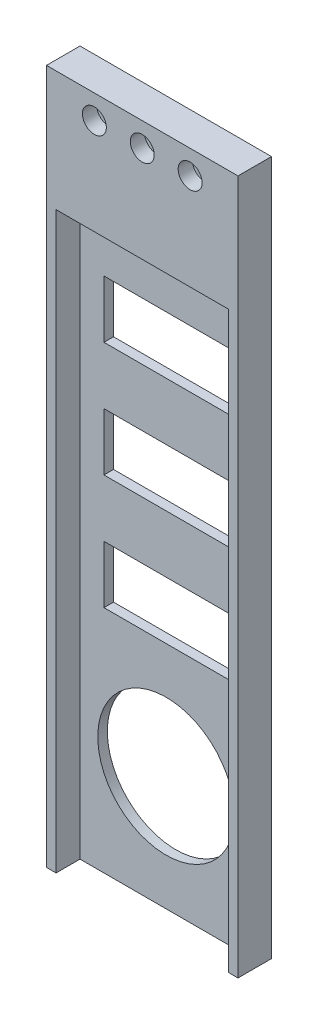
ISO-10303-21;
HEADER;
FILE_DESCRIPTION(('STEP AP214'),'2;1');
FILE_NAME('part.step','',(''),(''),'','','');
FILE_SCHEMA(('AUTOMOTIVE_DESIGN { 1 0 10303 214 1 1 1 1 }'));
ENDSEC;
DATA;
#1=APPLICATION_CONTEXT('core data for automotive mechanical design processes');
#2=APPLICATION_PROTOCOL_DEFINITION('international standard','automotive_design',2000,#1);
#3=PRODUCT_CONTEXT('',#1,'mechanical');
#4=PRODUCT('Part','Part','',(#3));
#5=PRODUCT_RELATED_PRODUCT_CATEGORY('part','',(#4));
#6=PRODUCT_DEFINITION_FORMATION('','',#4);
#7=PRODUCT_DEFINITION_CONTEXT('part definition',#1,'design');
#8=PRODUCT_DEFINITION('design','',#6,#7);
#9=PRODUCT_DEFINITION_SHAPE('','',#8);
#10=(LENGTH_UNIT() NAMED_UNIT(*) SI_UNIT(.MILLI.,.METRE.));
#11=(NAMED_UNIT(*) PLANE_ANGLE_UNIT() SI_UNIT($,.RADIAN.));
#12=(NAMED_UNIT(*) SI_UNIT($,.STERADIAN.) SOLID_ANGLE_UNIT());
#13=UNCERTAINTY_MEASURE_WITH_UNIT(LENGTH_MEASURE(1.E-05),#10,'distance_accuracy_value','');
#14=(GEOMETRIC_REPRESENTATION_CONTEXT(3) GLOBAL_UNCERTAINTY_ASSIGNED_CONTEXT((#13)) GLOBAL_UNIT_ASSIGNED_CONTEXT((#10,
#11,#12)) REPRESENTATION_CONTEXT('',''));
#15=CARTESIAN_POINT('',(0.,0.,0.));
#16=DIRECTION('',(0.,0.,1.));
#17=DIRECTION('',(1.,0.,0.));
#18=AXIS2_PLACEMENT_3D('',#15,#16,#17);
#19=CARTESIAN_POINT('',(20.,140.1,0.));
#20=DIRECTION('',(0.,0.,1.));
#21=DIRECTION('',(1.,0.,0.));
#22=AXIS2_PLACEMENT_3D('',#19,#20,#21);
#23=CYLINDRICAL_SURFACE('',#22,1.25);
#24=CARTESIAN_POINT('',(20.,140.1,0.));
#25=DIRECTION('',(0.,0.,1.));
#26=DIRECTION('',(1.,0.,0.));
#27=AXIS2_PLACEMENT_3D('',#24,#25,#26);
#28=CIRCLE('',#27,1.25);
#29=CARTESIAN_POINT('',(21.25,140.1,0.));
#30=VERTEX_POINT('',#29);
#31=EDGE_CURVE('E296',#30,#30,#28,.T.);
#32=ORIENTED_EDGE('',*,*,#31,.F.);
#33=EDGE_LOOP('',(#32));
#34=FACE_BOUND('',#33,.T.);
#35=CARTESIAN_POINT('',(20.,140.1,4.));
#36=DIRECTION('',(0.,0.,1.));
#37=DIRECTION('',(1.,0.,0.));
#38=AXIS2_PLACEMENT_3D('',#35,#36,#37);
#39=CIRCLE('',#38,1.25);
#40=CARTESIAN_POINT('',(21.25,140.1,4.));
#41=VERTEX_POINT('',#40);
#42=EDGE_CURVE('E38',#41,#41,#39,.F.);
#43=ORIENTED_EDGE('',*,*,#42,.F.);
#44=EDGE_LOOP('',(#43));
#45=FACE_BOUND('',#44,.T.);
#46=ADVANCED_FACE('F34',(#34,#45),#23,.F.);
#47=CARTESIAN_POINT('',(10.,140.1,0.));
#48=DIRECTION('',(0.,0.,1.));
#49=DIRECTION('',(1.,0.,0.));
#50=AXIS2_PLACEMENT_3D('',#47,#48,#49);
#51=CYLINDRICAL_SURFACE('',#50,1.25);
#52=CARTESIAN_POINT('',(10.,140.1,0.));
#53=DIRECTION('',(0.,0.,1.));
#54=DIRECTION('',(1.,0.,0.));
#55=AXIS2_PLACEMENT_3D('',#52,#53,#54);
#56=CIRCLE('',#55,1.25);
#57=CARTESIAN_POINT('',(11.25,140.1,0.));
#58=VERTEX_POINT('',#57);
#59=EDGE_CURVE('E293',#58,#58,#56,.T.);
#60=ORIENTED_EDGE('',*,*,#59,.F.);
#61=EDGE_LOOP('',(#60));
#62=FACE_BOUND('',#61,.T.);
#63=CARTESIAN_POINT('',(10.,140.1,4.));
#64=DIRECTION('',(0.,0.,1.));
#65=DIRECTION('',(1.,0.,0.));
#66=AXIS2_PLACEMENT_3D('',#63,#64,#65);
#67=CIRCLE('',#66,1.25);
#68=CARTESIAN_POINT('',(11.25,140.1,4.));
#69=VERTEX_POINT('',#68);
#70=EDGE_CURVE('E369',#69,#69,#67,.F.);
#71=ORIENTED_EDGE('',*,*,#70,.F.);
#72=EDGE_LOOP('',(#71));
#73=FACE_BOUND('',#72,.T.);
#74=ADVANCED_FACE('F379',(#62,#73),#51,.F.);
#75=CARTESIAN_POINT('',(30.,140.1,0.));
#76=DIRECTION('',(0.,0.,1.));
#77=DIRECTION('',(1.,0.,0.));
#78=AXIS2_PLACEMENT_3D('',#75,#76,#77);
#79=CYLINDRICAL_SURFACE('',#78,1.25);
#80=CARTESIAN_POINT('',(30.,140.1,0.));
#81=DIRECTION('',(0.,0.,1.));
#82=DIRECTION('',(1.,0.,0.));
#83=AXIS2_PLACEMENT_3D('',#80,#81,#82);
#84=CIRCLE('',#83,1.25);
#85=CARTESIAN_POINT('',(31.25,140.1,0.));
#86=VERTEX_POINT('',#85);
#87=EDGE_CURVE('E297',#86,#86,#84,.T.);
#88=ORIENTED_EDGE('',*,*,#87,.F.);
#89=EDGE_LOOP('',(#88));
#90=FACE_BOUND('',#89,.T.);
#91=CARTESIAN_POINT('',(30.,140.1,4.));
#92=DIRECTION('',(0.,0.,1.));
#93=DIRECTION('',(1.,0.,0.));
#94=AXIS2_PLACEMENT_3D('',#91,#92,#93);
#95=CIRCLE('',#94,1.25);
#96=CARTESIAN_POINT('',(31.25,140.1,4.));
#97=VERTEX_POINT('',#96);
#98=EDGE_CURVE('E278',#97,#97,#95,.F.);
#99=ORIENTED_EDGE('',*,*,#98,.F.);
#100=EDGE_LOOP('',(#99));
#101=FACE_BOUND('',#100,.T.);
#102=ADVANCED_FACE('F385',(#90,#101),#79,.F.);
#103=CARTESIAN_POINT('',(0.,0.,2.));
#104=DIRECTION('',(0.,0.,-1.));
#105=DIRECTION('',(-1.,0.,0.));
#106=AXIS2_PLACEMENT_3D('',#103,#104,#105);
#107=PLANE('',#106);
#108=DIRECTION('',(1.,0.,0.));
#109=VECTOR('',#108,1.);
#110=CARTESIAN_POINT('',(7.,96.,2.));
#111=LINE('',#110,#109);
#112=CARTESIAN_POINT('',(7.,96.,2.));
#113=VERTEX_POINT('',#112);
#114=CARTESIAN_POINT('',(33.,96.,2.));
#115=VERTEX_POINT('',#114);
#116=EDGE_CURVE('E203',#113,#115,#111,.T.);
#117=ORIENTED_EDGE('',*,*,#116,.F.);
#118=DIRECTION('',(0.,-1.,0.));
#119=VECTOR('',#118,1.);
#120=CARTESIAN_POINT('',(7.,108.,2.));
#121=LINE('',#120,#119);
#122=CARTESIAN_POINT('',(7.,108.,2.));
#123=VERTEX_POINT('',#122);
#124=EDGE_CURVE('E51',#123,#113,#121,.T.);
#125=ORIENTED_EDGE('',*,*,#124,.F.);
#126=DIRECTION('',(-1.,0.,0.));
#127=VECTOR('',#126,1.);
#128=CARTESIAN_POINT('',(7.,108.,2.));
#129=LINE('',#128,#127);
#130=CARTESIAN_POINT('',(33.,108.,2.));
#131=VERTEX_POINT('',#130);
#132=EDGE_CURVE('E194',#131,#123,#129,.T.);
#133=ORIENTED_EDGE('',*,*,#132,.F.);
#134=DIRECTION('',(0.,1.,0.));
#135=VECTOR('',#134,1.);
#136=CARTESIAN_POINT('',(33.,108.,2.));
#137=LINE('',#136,#135);
#138=EDGE_CURVE('E197',#115,#131,#137,.T.);
#139=ORIENTED_EDGE('',*,*,#138,.F.);
#140=EDGE_LOOP('',(#117,#125,#133,#139));
#141=FACE_BOUND('',#140,.T.);
#142=DIRECTION('',(1.,0.,0.));
#143=VECTOR('',#142,1.);
#144=CARTESIAN_POINT('',(6.99999999999999,72.,2.));
#145=LINE('',#144,#143);
#146=CARTESIAN_POINT('',(6.99999999999999,72.,2.));
#147=VERTEX_POINT('',#146);
#148=CARTESIAN_POINT('',(33.,72.,2.));
#149=VERTEX_POINT('',#148);
#150=EDGE_CURVE('E229',#147,#149,#145,.T.);
#151=ORIENTED_EDGE('',*,*,#150,.F.);
#152=DIRECTION('',(0.,-1.,0.));
#153=VECTOR('',#152,1.);
#154=CARTESIAN_POINT('',(6.99999999999999,84.,2.));
#155=LINE('',#154,#153);
#156=CARTESIAN_POINT('',(6.99999999999999,84.,2.));
#157=VERTEX_POINT('',#156);
#158=EDGE_CURVE('E59',#157,#147,#155,.T.);
#159=ORIENTED_EDGE('',*,*,#158,.F.);
#160=DIRECTION('',(-1.,0.,0.));
#161=VECTOR('',#160,1.);
#162=CARTESIAN_POINT('',(6.99999999999999,84.,2.));
#163=LINE('',#162,#161);
#164=CARTESIAN_POINT('',(33.,84.,2.));
#165=VERTEX_POINT('',#164);
#166=EDGE_CURVE('E218',#165,#157,#163,.T.);
#167=ORIENTED_EDGE('',*,*,#166,.F.);
#168=DIRECTION('',(0.,1.,0.));
#169=VECTOR('',#168,1.);
#170=CARTESIAN_POINT('',(33.,84.,2.));
#171=LINE('',#170,#169);
#172=EDGE_CURVE('E233',#149,#165,#171,.T.);
#173=ORIENTED_EDGE('',*,*,#172,.F.);
#174=EDGE_LOOP('',(#151,#159,#167,#173));
#175=FACE_BOUND('',#174,.T.);
#176=DIRECTION('',(1.,0.,0.));
#177=VECTOR('',#176,1.);
#178=CARTESIAN_POINT('',(6.99999999999999,48.,2.));
#179=LINE('',#178,#177);
#180=CARTESIAN_POINT('',(6.99999999999999,48.,2.));
#181=VERTEX_POINT('',#180);
#182=CARTESIAN_POINT('',(33.,48.,2.));
#183=VERTEX_POINT('',#182);
#184=EDGE_CURVE('E260',#181,#183,#179,.T.);
#185=ORIENTED_EDGE('',*,*,#184,.F.);
#186=DIRECTION('',(0.,-1.,0.));
#187=VECTOR('',#186,1.);
#188=CARTESIAN_POINT('',(6.99999999999999,48.,2.));
#189=LINE('',#188,#187);
#190=CARTESIAN_POINT('',(6.99999999999999,60.,2.));
#191=VERTEX_POINT('',#190);
#192=EDGE_CURVE('E258',#191,#181,#189,.T.);
#193=ORIENTED_EDGE('',*,*,#192,.F.);
#194=DIRECTION('',(-1.,0.,0.));
#195=VECTOR('',#194,1.);
#196=CARTESIAN_POINT('',(6.99999999999999,60.,2.));
#197=LINE('',#196,#195);
#198=CARTESIAN_POINT('',(33.,60.,2.));
#199=VERTEX_POINT('',#198);
#200=EDGE_CURVE('E248',#199,#191,#197,.T.);
#201=ORIENTED_EDGE('',*,*,#200,.F.);
#202=DIRECTION('',(0.,1.,0.));
#203=VECTOR('',#202,1.);
#204=CARTESIAN_POINT('',(33.,48.,2.));
#205=LINE('',#204,#203);
#206=EDGE_CURVE('E263',#183,#199,#205,.T.);
#207=ORIENTED_EDGE('',*,*,#206,.F.);
#208=EDGE_LOOP('',(#185,#193,#201,#207));
#209=FACE_BOUND('',#208,.T.);
#210=CARTESIAN_POINT('',(20.,24.,2.));
#211=DIRECTION('',(0.,0.,1.));
#212=DIRECTION('',(1.,0.,0.));
#213=AXIS2_PLACEMENT_3D('',#210,#211,#212);
#214=CIRCLE('',#213,14.29);
#215=CARTESIAN_POINT('',(34.29,24.,2.));
#216=VERTEX_POINT('',#215);
#217=EDGE_CURVE('E343',#216,#216,#214,.T.);
#218=ORIENTED_EDGE('',*,*,#217,.F.);
#219=EDGE_LOOP('',(#218));
#220=FACE_BOUND('',#219,.T.);
#221=DIRECTION('',(0.,-1.,0.));
#222=VECTOR('',#221,1.);
#223=CARTESIAN_POINT('',(38.,0.,2.));
#224=LINE('',#223,#222);
#225=CARTESIAN_POINT('',(38.,120.,2.));
#226=VERTEX_POINT('',#225);
#227=CARTESIAN_POINT('',(38.,0.,2.));
#228=VERTEX_POINT('',#227);
#229=EDGE_CURVE('E307',#226,#228,#224,.T.);
#230=ORIENTED_EDGE('',*,*,#229,.F.);
#231=DIRECTION('',(1.,0.,0.));
#232=VECTOR('',#231,1.);
#233=CARTESIAN_POINT('',(38.,120.,2.));
#234=LINE('',#233,#232);
#235=CARTESIAN_POINT('',(1.99999999999999,120.,2.));
#236=VERTEX_POINT('',#235);
#237=EDGE_CURVE('E327',#236,#226,#234,.T.);
#238=ORIENTED_EDGE('',*,*,#237,.F.);
#239=DIRECTION('',(0.,1.,0.));
#240=VECTOR('',#239,1.);
#241=CARTESIAN_POINT('',(1.99999999999999,120.,2.));
#242=LINE('',#241,#240);
#243=CARTESIAN_POINT('',(1.99999999999999,0.,2.));
#244=VERTEX_POINT('',#243);
#245=EDGE_CURVE('E302',#244,#236,#242,.T.);
#246=ORIENTED_EDGE('',*,*,#245,.F.);
#247=DIRECTION('',(1.,0.,0.));
#248=VECTOR('',#247,1.);
#249=CARTESIAN_POINT('',(0.,0.,2.));
#250=LINE('',#249,#248);
#251=EDGE_CURVE('E350',#244,#228,#250,.T.);
#252=ORIENTED_EDGE('',*,*,#251,.T.);
#253=EDGE_LOOP('',(#230,#238,#246,#252));
#254=FACE_BOUND('',#253,.T.);
#255=ADVANCED_FACE('F412',(#141,#175,#209,#220,#254),#107,.F.);
#256=CARTESIAN_POINT('',(0.,0.,2.));
#257=DIRECTION('',(1.,0.,0.));
#258=DIRECTION('',(0.,0.,-1.));
#259=AXIS2_PLACEMENT_3D('',#256,#257,#258);
#260=PLANE('',#259);
#261=DIRECTION('',(0.,-1.,0.));
#262=VECTOR('',#261,1.);
#263=CARTESIAN_POINT('',(0.,0.,0.));
#264=LINE('',#263,#262);
#265=CARTESIAN_POINT('',(0.,145.1,0.));
#266=VERTEX_POINT('',#265);
#267=CARTESIAN_POINT('',(0.,0.,0.));
#268=VERTEX_POINT('',#267);
#269=EDGE_CURVE('E347',#266,#268,#264,.T.);
#270=ORIENTED_EDGE('',*,*,#269,.T.);
#271=DIRECTION('',(0.,0.,-1.));
#272=VECTOR('',#271,1.);
#273=CARTESIAN_POINT('',(0.,0.,2.));
#274=LINE('',#273,#272);
#275=CARTESIAN_POINT('',(0.,0.,7.));
#276=VERTEX_POINT('',#275);
#277=EDGE_CURVE('E11',#276,#268,#274,.T.);
#278=ORIENTED_EDGE('',*,*,#277,.F.);
#279=DIRECTION('',(0.,-1.,0.));
#280=VECTOR('',#279,1.);
#281=CARTESIAN_POINT('',(0.,0.,7.));
#282=LINE('',#281,#280);
#283=CARTESIAN_POINT('',(0.,145.1,7.));
#284=VERTEX_POINT('',#283);
#285=EDGE_CURVE('E303',#284,#276,#282,.T.);
#286=ORIENTED_EDGE('',*,*,#285,.F.);
#287=DIRECTION('',(0.,0.,-1.));
#288=VECTOR('',#287,1.);
#289=CARTESIAN_POINT('',(0.,145.1,2.));
#290=LINE('',#289,#288);
#291=EDGE_CURVE('E352',#284,#266,#290,.T.);
#292=ORIENTED_EDGE('',*,*,#291,.T.);
#293=EDGE_LOOP('',(#270,#278,#286,#292));
#294=FACE_BOUND('',#293,.T.);
#295=ADVANCED_FACE('F36',(#294),#260,.F.);
#296=CARTESIAN_POINT('',(0.,0.,2.));
#297=DIRECTION('',(0.,1.,0.));
#298=DIRECTION('',(0.,0.,1.));
#299=AXIS2_PLACEMENT_3D('',#296,#297,#298);
#300=PLANE('',#299);
#301=DIRECTION('',(1.,0.,0.));
#302=VECTOR('',#301,1.);
#303=CARTESIAN_POINT('',(0.,0.,0.));
#304=LINE('',#303,#302);
#305=CARTESIAN_POINT('',(40.,0.,0.));
#306=VERTEX_POINT('',#305);
#307=EDGE_CURVE('E356',#268,#306,#304,.T.);
#308=ORIENTED_EDGE('',*,*,#307,.T.);
#309=DIRECTION('',(0.,0.,-1.));
#310=VECTOR('',#309,1.);
#311=CARTESIAN_POINT('',(40.,0.,2.));
#312=LINE('',#311,#310);
#313=CARTESIAN_POINT('',(40.,0.,7.));
#314=VERTEX_POINT('',#313);
#315=EDGE_CURVE('E43',#314,#306,#312,.T.);
#316=ORIENTED_EDGE('',*,*,#315,.F.);
#317=DIRECTION('',(1.,0.,0.));
#318=VECTOR('',#317,1.);
#319=CARTESIAN_POINT('',(40.,0.,7.));
#320=LINE('',#319,#318);
#321=CARTESIAN_POINT('',(38.,0.,7.));
#322=VERTEX_POINT('',#321);
#323=EDGE_CURVE('E315',#322,#314,#320,.T.);
#324=ORIENTED_EDGE('',*,*,#323,.F.);
#325=DIRECTION('',(0.,0.,-1.));
#326=VECTOR('',#325,1.);
#327=CARTESIAN_POINT('',(38.,0.,7.));
#328=LINE('',#327,#326);
#329=EDGE_CURVE('E324',#322,#228,#328,.T.);
#330=ORIENTED_EDGE('',*,*,#329,.T.);
#331=ORIENTED_EDGE('',*,*,#251,.F.);
#332=DIRECTION('',(0.,0.,-1.));
#333=VECTOR('',#332,1.);
#334=CARTESIAN_POINT('',(2.,0.,7.));
#335=LINE('',#334,#333);
#336=CARTESIAN_POINT('',(2.,0.,7.));
#337=VERTEX_POINT('',#336);
#338=EDGE_CURVE('E340',#337,#244,#335,.T.);
#339=ORIENTED_EDGE('',*,*,#338,.F.);
#340=DIRECTION('',(1.,0.,0.));
#341=VECTOR('',#340,1.);
#342=CARTESIAN_POINT('',(2.,0.,7.));
#343=LINE('',#342,#341);
#344=EDGE_CURVE('E306',#276,#337,#343,.T.);
#345=ORIENTED_EDGE('',*,*,#344,.F.);
#346=ORIENTED_EDGE('',*,*,#277,.T.);
#347=EDGE_LOOP('',(#308,#316,#324,#330,#331,#339,#345,#346));
#348=FACE_BOUND('',#347,.T.);
#349=ADVANCED_FACE('F424',(#348),#300,.F.);
#350=CARTESIAN_POINT('',(40.,0.,2.));
#351=DIRECTION('',(-1.,0.,0.));
#352=DIRECTION('',(0.,0.,1.));
#353=AXIS2_PLACEMENT_3D('',#350,#351,#352);
#354=PLANE('',#353);
#355=DIRECTION('',(0.,1.,0.));
#356=VECTOR('',#355,1.);
#357=CARTESIAN_POINT('',(40.,0.,0.));
#358=LINE('',#357,#356);
#359=CARTESIAN_POINT('',(40.,145.1,0.));
#360=VERTEX_POINT('',#359);
#361=EDGE_CURVE('E358',#306,#360,#358,.T.);
#362=ORIENTED_EDGE('',*,*,#361,.T.);
#363=DIRECTION('',(0.,0.,-1.));
#364=VECTOR('',#363,1.);
#365=CARTESIAN_POINT('',(40.,145.1,2.));
#366=LINE('',#365,#364);
#367=CARTESIAN_POINT('',(40.,145.1,7.));
#368=VERTEX_POINT('',#367);
#369=EDGE_CURVE('E363',#368,#360,#366,.T.);
#370=ORIENTED_EDGE('',*,*,#369,.F.);
#371=DIRECTION('',(0.,1.,0.));
#372=VECTOR('',#371,1.);
#373=CARTESIAN_POINT('',(40.,145.1,7.));
#374=LINE('',#373,#372);
#375=EDGE_CURVE('E318',#314,#368,#374,.T.);
#376=ORIENTED_EDGE('',*,*,#375,.F.);
#377=ORIENTED_EDGE('',*,*,#315,.T.);
#378=EDGE_LOOP('',(#362,#370,#376,#377));
#379=FACE_BOUND('',#378,.T.);
#380=ADVANCED_FACE('F421',(#379),#354,.F.);
#381=CARTESIAN_POINT('',(0.,145.1,2.));
#382=DIRECTION('',(0.,-1.,0.));
#383=DIRECTION('',(0.,0.,-1.));
#384=AXIS2_PLACEMENT_3D('',#381,#382,#383);
#385=PLANE('',#384);
#386=DIRECTION('',(-1.,0.,0.));
#387=VECTOR('',#386,1.);
#388=CARTESIAN_POINT('',(0.,145.1,0.));
#389=LINE('',#388,#387);
#390=EDGE_CURVE('E353',#360,#266,#389,.T.);
#391=ORIENTED_EDGE('',*,*,#390,.T.);
#392=ORIENTED_EDGE('',*,*,#291,.F.);
#393=DIRECTION('',(-1.,0.,0.));
#394=VECTOR('',#393,1.);
#395=CARTESIAN_POINT('',(0.,145.1,7.));
#396=LINE('',#395,#394);
#397=EDGE_CURVE('E321',#368,#284,#396,.T.);
#398=ORIENTED_EDGE('',*,*,#397,.F.);
#399=ORIENTED_EDGE('',*,*,#369,.T.);
#400=EDGE_LOOP('',(#391,#392,#398,#399));
#401=FACE_BOUND('',#400,.T.);
#402=ADVANCED_FACE('F418',(#401),#385,.F.);
#403=CARTESIAN_POINT('',(0.,0.,0.));
#404=DIRECTION('',(0.,0.,-1.));
#405=DIRECTION('',(-1.,0.,0.));
#406=AXIS2_PLACEMENT_3D('',#403,#404,#405);
#407=PLANE('',#406);
#408=DIRECTION('',(0.,-1.,0.));
#409=VECTOR('',#408,1.);
#410=CARTESIAN_POINT('',(7.,108.,0.));
#411=LINE('',#410,#409);
#412=CARTESIAN_POINT('',(7.,108.,0.));
#413=VERTEX_POINT('',#412);
#414=CARTESIAN_POINT('',(7.,96.,0.));
#415=VERTEX_POINT('',#414);
#416=EDGE_CURVE('E175',#413,#415,#411,.T.);
#417=ORIENTED_EDGE('',*,*,#416,.T.);
#418=DIRECTION('',(1.,0.,0.));
#419=VECTOR('',#418,1.);
#420=CARTESIAN_POINT('',(7.,96.,0.));
#421=LINE('',#420,#419);
#422=CARTESIAN_POINT('',(33.,96.,0.));
#423=VERTEX_POINT('',#422);
#424=EDGE_CURVE('E185',#415,#423,#421,.T.);
#425=ORIENTED_EDGE('',*,*,#424,.T.);
#426=DIRECTION('',(0.,1.,0.));
#427=VECTOR('',#426,1.);
#428=CARTESIAN_POINT('',(33.,108.,0.));
#429=LINE('',#428,#427);
#430=CARTESIAN_POINT('',(33.,108.,0.));
#431=VERTEX_POINT('',#430);
#432=EDGE_CURVE('E189',#423,#431,#429,.T.);
#433=ORIENTED_EDGE('',*,*,#432,.T.);
#434=DIRECTION('',(-1.,0.,0.));
#435=VECTOR('',#434,1.);
#436=CARTESIAN_POINT('',(7.,108.,0.));
#437=LINE('',#436,#435);
#438=EDGE_CURVE('E181',#431,#413,#437,.T.);
#439=ORIENTED_EDGE('',*,*,#438,.T.);
#440=EDGE_LOOP('',(#417,#425,#433,#439));
#441=FACE_BOUND('',#440,.T.);
#442=DIRECTION('',(0.,-1.,0.));
#443=VECTOR('',#442,1.);
#444=CARTESIAN_POINT('',(6.99999999999999,84.,0.));
#445=LINE('',#444,#443);
#446=CARTESIAN_POINT('',(6.99999999999999,84.,0.));
#447=VERTEX_POINT('',#446);
#448=CARTESIAN_POINT('',(6.99999999999999,72.,0.));
#449=VERTEX_POINT('',#448);
#450=EDGE_CURVE('E214',#447,#449,#445,.T.);
#451=ORIENTED_EDGE('',*,*,#450,.T.);
#452=DIRECTION('',(1.,0.,0.));
#453=VECTOR('',#452,1.);
#454=CARTESIAN_POINT('',(6.99999999999999,72.,0.));
#455=LINE('',#454,#453);
#456=CARTESIAN_POINT('',(33.,72.,0.));
#457=VERTEX_POINT('',#456);
#458=EDGE_CURVE('E217',#449,#457,#455,.T.);
#459=ORIENTED_EDGE('',*,*,#458,.T.);
#460=DIRECTION('',(0.,1.,0.));
#461=VECTOR('',#460,1.);
#462=CARTESIAN_POINT('',(33.,84.,0.));
#463=LINE('',#462,#461);
#464=CARTESIAN_POINT('',(33.,84.,0.));
#465=VERTEX_POINT('',#464);
#466=EDGE_CURVE('E221',#457,#465,#463,.T.);
#467=ORIENTED_EDGE('',*,*,#466,.T.);
#468=DIRECTION('',(-1.,0.,0.));
#469=VECTOR('',#468,1.);
#470=CARTESIAN_POINT('',(6.99999999999999,84.,0.));
#471=LINE('',#470,#469);
#472=EDGE_CURVE('E224',#465,#447,#471,.T.);
#473=ORIENTED_EDGE('',*,*,#472,.T.);
#474=EDGE_LOOP('',(#451,#459,#467,#473));
#475=FACE_BOUND('',#474,.T.);
#476=DIRECTION('',(0.,-1.,0.));
#477=VECTOR('',#476,1.);
#478=CARTESIAN_POINT('',(6.99999999999999,48.,0.));
#479=LINE('',#478,#477);
#480=CARTESIAN_POINT('',(6.99999999999999,60.,0.));
#481=VERTEX_POINT('',#480);
#482=CARTESIAN_POINT('',(6.99999999999999,48.,0.));
#483=VERTEX_POINT('',#482);
#484=EDGE_CURVE('E244',#481,#483,#479,.T.);
#485=ORIENTED_EDGE('',*,*,#484,.T.);
#486=DIRECTION('',(1.,0.,0.));
#487=VECTOR('',#486,1.);
#488=CARTESIAN_POINT('',(6.99999999999999,48.,0.));
#489=LINE('',#488,#487);
#490=CARTESIAN_POINT('',(33.,48.,0.));
#491=VERTEX_POINT('',#490);
#492=EDGE_CURVE('E247',#483,#491,#489,.T.);
#493=ORIENTED_EDGE('',*,*,#492,.T.);
#494=DIRECTION('',(0.,1.,0.));
#495=VECTOR('',#494,1.);
#496=CARTESIAN_POINT('',(33.,48.,0.));
#497=LINE('',#496,#495);
#498=CARTESIAN_POINT('',(33.,60.,0.));
#499=VERTEX_POINT('',#498);
#500=EDGE_CURVE('E251',#491,#499,#497,.T.);
#501=ORIENTED_EDGE('',*,*,#500,.T.);
#502=DIRECTION('',(-1.,0.,0.));
#503=VECTOR('',#502,1.);
#504=CARTESIAN_POINT('',(6.99999999999999,60.,0.));
#505=LINE('',#504,#503);
#506=EDGE_CURVE('E254',#499,#481,#505,.T.);
#507=ORIENTED_EDGE('',*,*,#506,.T.);
#508=EDGE_LOOP('',(#485,#493,#501,#507));
#509=FACE_BOUND('',#508,.T.);
#510=ORIENTED_EDGE('',*,*,#87,.T.);
#511=EDGE_LOOP('',(#510));
#512=FACE_BOUND('',#511,.T.);
#513=ORIENTED_EDGE('',*,*,#59,.T.);
#514=EDGE_LOOP('',(#513));
#515=FACE_BOUND('',#514,.T.);
#516=ORIENTED_EDGE('',*,*,#31,.T.);
#517=EDGE_LOOP('',(#516));
#518=FACE_BOUND('',#517,.T.);
#519=CARTESIAN_POINT('',(20.,24.,0.));
#520=DIRECTION('',(0.,0.,1.));
#521=DIRECTION('',(1.,0.,0.));
#522=AXIS2_PLACEMENT_3D('',#519,#520,#521);
#523=CIRCLE('',#522,14.29);
#524=CARTESIAN_POINT('',(34.29,24.,0.));
#525=VERTEX_POINT('',#524);
#526=EDGE_CURVE('E344',#525,#525,#523,.T.);
#527=ORIENTED_EDGE('',*,*,#526,.T.);
#528=EDGE_LOOP('',(#527));
#529=FACE_BOUND('',#528,.T.);
#530=ORIENTED_EDGE('',*,*,#269,.F.);
#531=ORIENTED_EDGE('',*,*,#390,.F.);
#532=ORIENTED_EDGE('',*,*,#361,.F.);
#533=ORIENTED_EDGE('',*,*,#307,.F.);
#534=EDGE_LOOP('',(#530,#531,#532,#533));
#535=FACE_BOUND('',#534,.T.);
#536=ADVANCED_FACE('F191',(#441,#475,#509,#512,#515,#518,#529,#535),#407,.T.);
#537=CARTESIAN_POINT('',(20.,24.,0.));
#538=DIRECTION('',(0.,0.,1.));
#539=DIRECTION('',(1.,0.,0.));
#540=AXIS2_PLACEMENT_3D('',#537,#538,#539);
#541=CYLINDRICAL_SURFACE('',#540,14.29);
#542=ORIENTED_EDGE('',*,*,#526,.F.);
#543=EDGE_LOOP('',(#542));
#544=FACE_BOUND('',#543,.T.);
#545=ORIENTED_EDGE('',*,*,#217,.T.);
#546=EDGE_LOOP('',(#545));
#547=FACE_BOUND('',#546,.T.);
#548=ADVANCED_FACE('F407',(#544,#547),#541,.F.);
#549=CARTESIAN_POINT('',(1.99999999999999,120.,7.));
#550=DIRECTION('',(-1.,0.,0.));
#551=DIRECTION('',(0.,-1.,0.));
#552=AXIS2_PLACEMENT_3D('',#549,#550,#551);
#553=PLANE('',#552);
#554=ORIENTED_EDGE('',*,*,#245,.T.);
#555=DIRECTION('',(0.,0.,-1.));
#556=VECTOR('',#555,1.);
#557=CARTESIAN_POINT('',(1.99999999999999,120.,7.));
#558=LINE('',#557,#556);
#559=CARTESIAN_POINT('',(1.99999999999999,120.,7.));
#560=VERTEX_POINT('',#559);
#561=EDGE_CURVE('E337',#560,#236,#558,.T.);
#562=ORIENTED_EDGE('',*,*,#561,.F.);
#563=DIRECTION('',(0.,1.,0.));
#564=VECTOR('',#563,1.);
#565=CARTESIAN_POINT('',(1.99999999999999,120.,7.));
#566=LINE('',#565,#564);
#567=EDGE_CURVE('E309',#337,#560,#566,.T.);
#568=ORIENTED_EDGE('',*,*,#567,.F.);
#569=ORIENTED_EDGE('',*,*,#338,.T.);
#570=EDGE_LOOP('',(#554,#562,#568,#569));
#571=FACE_BOUND('',#570,.T.);
#572=ADVANCED_FACE('F403',(#571),#553,.F.);
#573=CARTESIAN_POINT('',(38.,120.,7.));
#574=DIRECTION('',(0.,1.,0.));
#575=DIRECTION('',(0.,0.,1.));
#576=AXIS2_PLACEMENT_3D('',#573,#574,#575);
#577=PLANE('',#576);
#578=ORIENTED_EDGE('',*,*,#237,.T.);
#579=DIRECTION('',(0.,0.,-1.));
#580=VECTOR('',#579,1.);
#581=CARTESIAN_POINT('',(38.,120.,7.));
#582=LINE('',#581,#580);
#583=CARTESIAN_POINT('',(38.,120.,7.));
#584=VERTEX_POINT('',#583);
#585=EDGE_CURVE('E334',#584,#226,#582,.T.);
#586=ORIENTED_EDGE('',*,*,#585,.F.);
#587=DIRECTION('',(1.,0.,0.));
#588=VECTOR('',#587,1.);
#589=CARTESIAN_POINT('',(38.,120.,7.));
#590=LINE('',#589,#588);
#591=EDGE_CURVE('E311',#560,#584,#590,.T.);
#592=ORIENTED_EDGE('',*,*,#591,.F.);
#593=ORIENTED_EDGE('',*,*,#561,.T.);
#594=EDGE_LOOP('',(#578,#586,#592,#593));
#595=FACE_BOUND('',#594,.T.);
#596=ADVANCED_FACE('F399',(#595),#577,.F.);
#597=CARTESIAN_POINT('',(38.,0.,7.));
#598=DIRECTION('',(1.,0.,0.));
#599=DIRECTION('',(0.,0.,-1.));
#600=AXIS2_PLACEMENT_3D('',#597,#598,#599);
#601=PLANE('',#600);
#602=ORIENTED_EDGE('',*,*,#229,.T.);
#603=ORIENTED_EDGE('',*,*,#329,.F.);
#604=DIRECTION('',(0.,-1.,0.));
#605=VECTOR('',#604,1.);
#606=CARTESIAN_POINT('',(38.,0.,7.));
#607=LINE('',#606,#605);
#608=EDGE_CURVE('E313',#584,#322,#607,.T.);
#609=ORIENTED_EDGE('',*,*,#608,.F.);
#610=ORIENTED_EDGE('',*,*,#585,.T.);
#611=EDGE_LOOP('',(#602,#603,#609,#610));
#612=FACE_BOUND('',#611,.T.);
#613=ADVANCED_FACE('F395',(#612),#601,.F.);
#614=CARTESIAN_POINT('',(0.,0.,7.));
#615=DIRECTION('',(0.,0.,-1.));
#616=DIRECTION('',(-1.,0.,0.));
#617=AXIS2_PLACEMENT_3D('',#614,#615,#616);
#618=PLANE('',#617);
#619=CARTESIAN_POINT('',(10.,140.1,7.));
#620=DIRECTION('',(0.,0.,1.));
#621=DIRECTION('',(1.,0.,0.));
#622=AXIS2_PLACEMENT_3D('',#619,#620,#621);
#623=CIRCLE('',#622,2.5);
#624=CARTESIAN_POINT('',(12.5,140.1,7.));
#625=VERTEX_POINT('',#624);
#626=EDGE_CURVE('E279',#625,#625,#623,.T.);
#627=ORIENTED_EDGE('',*,*,#626,.F.);
#628=EDGE_LOOP('',(#627));
#629=FACE_BOUND('',#628,.T.);
#630=CARTESIAN_POINT('',(20.,140.1,7.));
#631=DIRECTION('',(0.,0.,1.));
#632=DIRECTION('',(1.,0.,0.));
#633=AXIS2_PLACEMENT_3D('',#630,#631,#632);
#634=CIRCLE('',#633,2.5);
#635=CARTESIAN_POINT('',(22.5,140.1,7.));
#636=VERTEX_POINT('',#635);
#637=EDGE_CURVE('E285',#636,#636,#634,.T.);
#638=ORIENTED_EDGE('',*,*,#637,.F.);
#639=EDGE_LOOP('',(#638));
#640=FACE_BOUND('',#639,.T.);
#641=CARTESIAN_POINT('',(30.,140.1,7.));
#642=DIRECTION('',(0.,0.,1.));
#643=DIRECTION('',(1.,0.,0.));
#644=AXIS2_PLACEMENT_3D('',#641,#642,#643);
#645=CIRCLE('',#644,2.5);
#646=CARTESIAN_POINT('',(32.5,140.1,7.));
#647=VERTEX_POINT('',#646);
#648=EDGE_CURVE('E210',#647,#647,#645,.T.);
#649=ORIENTED_EDGE('',*,*,#648,.F.);
#650=EDGE_LOOP('',(#649));
#651=FACE_BOUND('',#650,.T.);
#652=ORIENTED_EDGE('',*,*,#285,.T.);
#653=ORIENTED_EDGE('',*,*,#344,.T.);
#654=ORIENTED_EDGE('',*,*,#567,.T.);
#655=ORIENTED_EDGE('',*,*,#591,.T.);
#656=ORIENTED_EDGE('',*,*,#608,.T.);
#657=ORIENTED_EDGE('',*,*,#323,.T.);
#658=ORIENTED_EDGE('',*,*,#375,.T.);
#659=ORIENTED_EDGE('',*,*,#397,.T.);
#660=EDGE_LOOP('',(#652,#653,#654,#655,#656,#657,#658,#659));
#661=FACE_BOUND('',#660,.T.);
#662=ADVANCED_FACE('F391',(#629,#640,#651,#661),#618,.F.);
#663=CARTESIAN_POINT('',(30.,140.1,4.));
#664=DIRECTION('',(0.,0.,1.));
#665=DIRECTION('',(1.,0.,0.));
#666=AXIS2_PLACEMENT_3D('',#663,#664,#665);
#667=PLANE('',#666);
#668=CARTESIAN_POINT('',(30.,140.1,4.));
#669=DIRECTION('',(0.,0.,1.));
#670=DIRECTION('',(1.,0.,0.));
#671=AXIS2_PLACEMENT_3D('',#668,#669,#670);
#672=CIRCLE('',#671,2.5);
#673=CARTESIAN_POINT('',(32.5,140.1,4.));
#674=VERTEX_POINT('',#673);
#675=EDGE_CURVE('E288',#674,#674,#672,.T.);
#676=ORIENTED_EDGE('',*,*,#675,.T.);
#677=EDGE_LOOP('',(#676));
#678=FACE_BOUND('',#677,.T.);
#679=ORIENTED_EDGE('',*,*,#98,.T.);
#680=EDGE_LOOP('',(#679));
#681=FACE_BOUND('',#680,.T.);
#682=ADVANCED_FACE('F394',(#678,#681),#667,.T.);
#683=CARTESIAN_POINT('',(30.,140.1,4.));
#684=DIRECTION('',(0.,0.,1.));
#685=DIRECTION('',(1.,0.,0.));
#686=AXIS2_PLACEMENT_3D('',#683,#684,#685);
#687=CYLINDRICAL_SURFACE('',#686,2.5);
#688=ORIENTED_EDGE('',*,*,#675,.F.);
#689=EDGE_LOOP('',(#688));
#690=FACE_BOUND('',#689,.T.);
#691=ORIENTED_EDGE('',*,*,#648,.T.);
#692=EDGE_LOOP('',(#691));
#693=FACE_BOUND('',#692,.T.);
#694=ADVANCED_FACE('F666',(#690,#693),#687,.F.);
#695=CARTESIAN_POINT('',(10.,140.1,4.));
#696=DIRECTION('',(0.,0.,1.));
#697=DIRECTION('',(1.,0.,0.));
#698=AXIS2_PLACEMENT_3D('',#695,#696,#697);
#699=PLANE('',#698);
#700=CARTESIAN_POINT('',(10.,140.1,4.));
#701=DIRECTION('',(0.,0.,1.));
#702=DIRECTION('',(1.,0.,0.));
#703=AXIS2_PLACEMENT_3D('',#700,#701,#702);
#704=CIRCLE('',#703,2.5);
#705=CARTESIAN_POINT('',(12.5,140.1,4.));
#706=VERTEX_POINT('',#705);
#707=EDGE_CURVE('E275',#706,#706,#704,.T.);
#708=ORIENTED_EDGE('',*,*,#707,.T.);
#709=EDGE_LOOP('',(#708));
#710=FACE_BOUND('',#709,.T.);
#711=ORIENTED_EDGE('',*,*,#70,.T.);
#712=EDGE_LOOP('',(#711));
#713=FACE_BOUND('',#712,.T.);
#714=ADVANCED_FACE('F662',(#710,#713),#699,.T.);
#715=CARTESIAN_POINT('',(10.,140.1,4.));
#716=DIRECTION('',(0.,0.,1.));
#717=DIRECTION('',(1.,0.,0.));
#718=AXIS2_PLACEMENT_3D('',#715,#716,#717);
#719=CYLINDRICAL_SURFACE('',#718,2.5);
#720=ORIENTED_EDGE('',*,*,#707,.F.);
#721=EDGE_LOOP('',(#720));
#722=FACE_BOUND('',#721,.T.);
#723=ORIENTED_EDGE('',*,*,#626,.T.);
#724=EDGE_LOOP('',(#723));
#725=FACE_BOUND('',#724,.T.);
#726=ADVANCED_FACE('F665',(#722,#725),#719,.F.);
#727=CARTESIAN_POINT('',(20.,140.1,4.));
#728=DIRECTION('',(0.,0.,1.));
#729=DIRECTION('',(1.,0.,0.));
#730=AXIS2_PLACEMENT_3D('',#727,#728,#729);
#731=PLANE('',#730);
#732=CARTESIAN_POINT('',(20.,140.1,4.));
#733=DIRECTION('',(0.,0.,1.));
#734=DIRECTION('',(1.,0.,0.));
#735=AXIS2_PLACEMENT_3D('',#732,#733,#734);
#736=CIRCLE('',#735,2.5);
#737=CARTESIAN_POINT('',(22.5,140.1,4.));
#738=VERTEX_POINT('',#737);
#739=EDGE_CURVE('E282',#738,#738,#736,.T.);
#740=ORIENTED_EDGE('',*,*,#739,.T.);
#741=EDGE_LOOP('',(#740));
#742=FACE_BOUND('',#741,.T.);
#743=ORIENTED_EDGE('',*,*,#42,.T.);
#744=EDGE_LOOP('',(#743));
#745=FACE_BOUND('',#744,.T.);
#746=ADVANCED_FACE('F376',(#742,#745),#731,.T.);
#747=CARTESIAN_POINT('',(20.,140.1,4.));
#748=DIRECTION('',(0.,0.,1.));
#749=DIRECTION('',(1.,0.,0.));
#750=AXIS2_PLACEMENT_3D('',#747,#748,#749);
#751=CYLINDRICAL_SURFACE('',#750,2.5);
#752=ORIENTED_EDGE('',*,*,#739,.F.);
#753=EDGE_LOOP('',(#752));
#754=FACE_BOUND('',#753,.T.);
#755=ORIENTED_EDGE('',*,*,#637,.T.);
#756=EDGE_LOOP('',(#755));
#757=FACE_BOUND('',#756,.T.);
#758=ADVANCED_FACE('F550',(#754,#757),#751,.F.);
#759=CARTESIAN_POINT('',(6.99999999999999,48.,0.));
#760=DIRECTION('',(-1.,0.,0.));
#761=DIRECTION('',(0.,0.,1.));
#762=AXIS2_PLACEMENT_3D('',#759,#760,#761);
#763=PLANE('',#762);
#764=ORIENTED_EDGE('',*,*,#192,.T.);
#765=DIRECTION('',(0.,0.,1.));
#766=VECTOR('',#765,1.);
#767=CARTESIAN_POINT('',(6.99999999999999,48.,0.));
#768=LINE('',#767,#766);
#769=EDGE_CURVE('E257',#483,#181,#768,.T.);
#770=ORIENTED_EDGE('',*,*,#769,.F.);
#771=ORIENTED_EDGE('',*,*,#484,.F.);
#772=DIRECTION('',(0.,0.,1.));
#773=VECTOR('',#772,1.);
#774=CARTESIAN_POINT('',(6.99999999999999,60.,0.));
#775=LINE('',#774,#773);
#776=EDGE_CURVE('E230',#481,#191,#775,.T.);
#777=ORIENTED_EDGE('',*,*,#776,.T.);
#778=EDGE_LOOP('',(#764,#770,#771,#777));
#779=FACE_BOUND('',#778,.T.);
#780=ADVANCED_FACE('F544',(#779),#763,.F.);
#781=CARTESIAN_POINT('',(6.99999999999999,60.,0.));
#782=DIRECTION('',(0.,1.,0.));
#783=DIRECTION('',(0.,0.,1.));
#784=AXIS2_PLACEMENT_3D('',#781,#782,#783);
#785=PLANE('',#784);
#786=ORIENTED_EDGE('',*,*,#200,.T.);
#787=ORIENTED_EDGE('',*,*,#776,.F.);
#788=ORIENTED_EDGE('',*,*,#506,.F.);
#789=DIRECTION('',(0.,0.,1.));
#790=VECTOR('',#789,1.);
#791=CARTESIAN_POINT('',(33.,60.,0.));
#792=LINE('',#791,#790);
#793=EDGE_CURVE('E269',#499,#199,#792,.T.);
#794=ORIENTED_EDGE('',*,*,#793,.T.);
#795=EDGE_LOOP('',(#786,#787,#788,#794));
#796=FACE_BOUND('',#795,.T.);
#797=ADVANCED_FACE('F549',(#796),#785,.F.);
#798=CARTESIAN_POINT('',(33.,48.,0.));
#799=DIRECTION('',(1.,0.,0.));
#800=DIRECTION('',(0.,0.,-1.));
#801=AXIS2_PLACEMENT_3D('',#798,#799,#800);
#802=PLANE('',#801);
#803=ORIENTED_EDGE('',*,*,#206,.T.);
#804=ORIENTED_EDGE('',*,*,#793,.F.);
#805=ORIENTED_EDGE('',*,*,#500,.F.);
#806=DIRECTION('',(0.,0.,1.));
#807=VECTOR('',#806,1.);
#808=CARTESIAN_POINT('',(33.,48.,0.));
#809=LINE('',#808,#807);
#810=EDGE_CURVE('E271',#491,#183,#809,.T.);
#811=ORIENTED_EDGE('',*,*,#810,.T.);
#812=EDGE_LOOP('',(#803,#804,#805,#811));
#813=FACE_BOUND('',#812,.T.);
#814=ADVANCED_FACE('F562',(#813),#802,.F.);
#815=CARTESIAN_POINT('',(6.99999999999999,48.,0.));
#816=DIRECTION('',(0.,-1.,0.));
#817=DIRECTION('',(0.,0.,-1.));
#818=AXIS2_PLACEMENT_3D('',#815,#816,#817);
#819=PLANE('',#818);
#820=ORIENTED_EDGE('',*,*,#184,.T.);
#821=ORIENTED_EDGE('',*,*,#810,.F.);
#822=ORIENTED_EDGE('',*,*,#492,.F.);
#823=ORIENTED_EDGE('',*,*,#769,.T.);
#824=EDGE_LOOP('',(#820,#821,#822,#823));
#825=FACE_BOUND('',#824,.T.);
#826=ADVANCED_FACE('F572',(#825),#819,.F.);
#827=CARTESIAN_POINT('',(6.99999999999999,84.,0.));
#828=DIRECTION('',(-1.,0.,0.));
#829=DIRECTION('',(0.,-1.,0.));
#830=AXIS2_PLACEMENT_3D('',#827,#828,#829);
#831=PLANE('',#830);
#832=ORIENTED_EDGE('',*,*,#158,.T.);
#833=DIRECTION('',(0.,0.,1.));
#834=VECTOR('',#833,1.);
#835=CARTESIAN_POINT('',(6.99999999999999,72.,0.));
#836=LINE('',#835,#834);
#837=EDGE_CURVE('E227',#449,#147,#836,.T.);
#838=ORIENTED_EDGE('',*,*,#837,.F.);
#839=ORIENTED_EDGE('',*,*,#450,.F.);
#840=DIRECTION('',(0.,0.,1.));
#841=VECTOR('',#840,1.);
#842=CARTESIAN_POINT('',(6.99999999999999,84.,0.));
#843=LINE('',#842,#841);
#844=EDGE_CURVE('E204',#447,#157,#843,.T.);
#845=ORIENTED_EDGE('',*,*,#844,.T.);
#846=EDGE_LOOP('',(#832,#838,#839,#845));
#847=FACE_BOUND('',#846,.T.);
#848=ADVANCED_FACE('F582',(#847),#831,.F.);
#849=CARTESIAN_POINT('',(6.99999999999999,84.,0.));
#850=DIRECTION('',(0.,1.,0.));
#851=DIRECTION('',(0.,0.,1.));
#852=AXIS2_PLACEMENT_3D('',#849,#850,#851);
#853=PLANE('',#852);
#854=ORIENTED_EDGE('',*,*,#166,.T.);
#855=ORIENTED_EDGE('',*,*,#844,.F.);
#856=ORIENTED_EDGE('',*,*,#472,.F.);
#857=DIRECTION('',(0.,0.,1.));
#858=VECTOR('',#857,1.);
#859=CARTESIAN_POINT('',(33.,84.,0.));
#860=LINE('',#859,#858);
#861=EDGE_CURVE('E239',#465,#165,#860,.T.);
#862=ORIENTED_EDGE('',*,*,#861,.T.);
#863=EDGE_LOOP('',(#854,#855,#856,#862));
#864=FACE_BOUND('',#863,.T.);
#865=ADVANCED_FACE('F592',(#864),#853,.F.);
#866=CARTESIAN_POINT('',(33.,84.,0.));
#867=DIRECTION('',(1.,0.,0.));
#868=DIRECTION('',(0.,0.,-1.));
#869=AXIS2_PLACEMENT_3D('',#866,#867,#868);
#870=PLANE('',#869);
#871=ORIENTED_EDGE('',*,*,#172,.T.);
#872=ORIENTED_EDGE('',*,*,#861,.F.);
#873=ORIENTED_EDGE('',*,*,#466,.F.);
#874=DIRECTION('',(0.,0.,1.));
#875=VECTOR('',#874,1.);
#876=CARTESIAN_POINT('',(33.,72.,0.));
#877=LINE('',#876,#875);
#878=EDGE_CURVE('E241',#457,#149,#877,.T.);
#879=ORIENTED_EDGE('',*,*,#878,.T.);
#880=EDGE_LOOP('',(#871,#872,#873,#879));
#881=FACE_BOUND('',#880,.T.);
#882=ADVANCED_FACE('F601',(#881),#870,.F.);
#883=CARTESIAN_POINT('',(6.99999999999999,72.,0.));
#884=DIRECTION('',(0.,-1.,0.));
#885=DIRECTION('',(0.,0.,-1.));
#886=AXIS2_PLACEMENT_3D('',#883,#884,#885);
#887=PLANE('',#886);
#888=ORIENTED_EDGE('',*,*,#150,.T.);
#889=ORIENTED_EDGE('',*,*,#878,.F.);
#890=ORIENTED_EDGE('',*,*,#458,.F.);
#891=ORIENTED_EDGE('',*,*,#837,.T.);
#892=EDGE_LOOP('',(#888,#889,#890,#891));
#893=FACE_BOUND('',#892,.T.);
#894=ADVANCED_FACE('F611',(#893),#887,.F.);
#895=CARTESIAN_POINT('',(7.,108.,0.));
#896=DIRECTION('',(-1.,0.,0.));
#897=DIRECTION('',(0.,-1.,0.));
#898=AXIS2_PLACEMENT_3D('',#895,#896,#897);
#899=PLANE('',#898);
#900=ORIENTED_EDGE('',*,*,#124,.T.);
#901=DIRECTION('',(0.,0.,1.));
#902=VECTOR('',#901,1.);
#903=CARTESIAN_POINT('',(7.,96.,0.));
#904=LINE('',#903,#902);
#905=EDGE_CURVE('E171',#415,#113,#904,.T.);
#906=ORIENTED_EDGE('',*,*,#905,.F.);
#907=ORIENTED_EDGE('',*,*,#416,.F.);
#908=DIRECTION('',(0.,0.,1.));
#909=VECTOR('',#908,1.);
#910=CARTESIAN_POINT('',(7.,108.,0.));
#911=LINE('',#910,#909);
#912=EDGE_CURVE('E208',#413,#123,#911,.T.);
#913=ORIENTED_EDGE('',*,*,#912,.T.);
#914=EDGE_LOOP('',(#900,#906,#907,#913));
#915=FACE_BOUND('',#914,.T.);
#916=ADVANCED_FACE('F173',(#915),#899,.F.);
#917=CARTESIAN_POINT('',(7.,108.,0.));
#918=DIRECTION('',(0.,1.,0.));
#919=DIRECTION('',(0.,0.,1.));
#920=AXIS2_PLACEMENT_3D('',#917,#918,#919);
#921=PLANE('',#920);
#922=ORIENTED_EDGE('',*,*,#132,.T.);
#923=ORIENTED_EDGE('',*,*,#912,.F.);
#924=ORIENTED_EDGE('',*,*,#438,.F.);
#925=DIRECTION('',(0.,0.,1.));
#926=VECTOR('',#925,1.);
#927=CARTESIAN_POINT('',(33.,108.,0.));
#928=LINE('',#927,#926);
#929=EDGE_CURVE('E211',#431,#131,#928,.T.);
#930=ORIENTED_EDGE('',*,*,#929,.T.);
#931=EDGE_LOOP('',(#922,#923,#924,#930));
#932=FACE_BOUND('',#931,.T.);
#933=ADVANCED_FACE('F630',(#932),#921,.F.);
#934=CARTESIAN_POINT('',(33.,108.,0.));
#935=DIRECTION('',(1.,0.,0.));
#936=DIRECTION('',(0.,0.,-1.));
#937=AXIS2_PLACEMENT_3D('',#934,#935,#936);
#938=PLANE('',#937);
#939=ORIENTED_EDGE('',*,*,#138,.T.);
#940=ORIENTED_EDGE('',*,*,#929,.F.);
#941=ORIENTED_EDGE('',*,*,#432,.F.);
#942=DIRECTION('',(0.,0.,1.));
#943=VECTOR('',#942,1.);
#944=CARTESIAN_POINT('',(33.,96.,0.));
#945=LINE('',#944,#943);
#946=EDGE_CURVE('E180',#423,#115,#945,.T.);
#947=ORIENTED_EDGE('',*,*,#946,.T.);
#948=EDGE_LOOP('',(#939,#940,#941,#947));
#949=FACE_BOUND('',#948,.T.);
#950=ADVANCED_FACE('F639',(#949),#938,.F.);
#951=CARTESIAN_POINT('',(7.,96.,0.));
#952=DIRECTION('',(0.,-1.,0.));
#953=DIRECTION('',(0.,0.,-1.));
#954=AXIS2_PLACEMENT_3D('',#951,#952,#953);
#955=PLANE('',#954);
#956=ORIENTED_EDGE('',*,*,#116,.T.);
#957=ORIENTED_EDGE('',*,*,#946,.F.);
#958=ORIENTED_EDGE('',*,*,#424,.F.);
#959=ORIENTED_EDGE('',*,*,#905,.T.);
#960=EDGE_LOOP('',(#956,#957,#958,#959));
#961=FACE_BOUND('',#960,.T.);
#962=ADVANCED_FACE('F186',(#961),#955,.F.);
#963=CLOSED_SHELL('',(#46,#74,#102,#255,#295,#349,#380,#402,#536,#548,#572,#596,#613,#662,#682,
#694,#714,#726,#746,#758,#780,#797,#814,#826,#848,#865,#882,#894,#916,#933,#950,#962));
#964=MANIFOLD_SOLID_BREP('B2',#963);
#965=ADVANCED_BREP_SHAPE_REPRESENTATION('',(#18,#964),#14);
#966=SHAPE_DEFINITION_REPRESENTATION(#9,#965);
ENDSEC;
END-ISO-10303-21;
